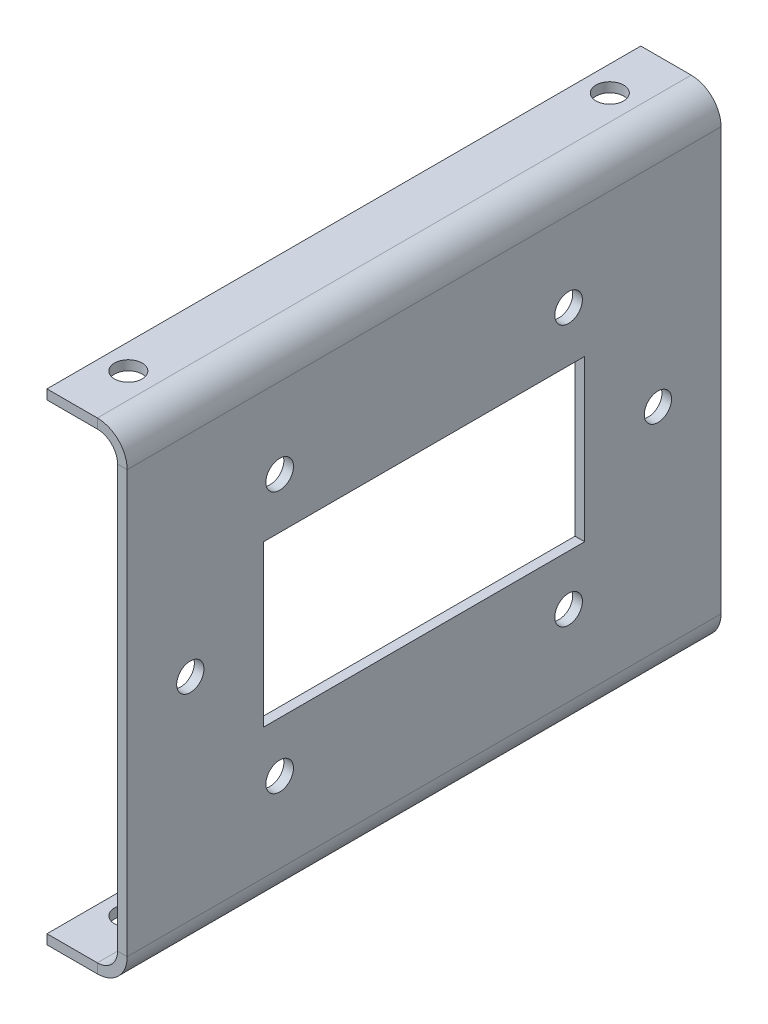
ISO-10303-21;
HEADER;
FILE_DESCRIPTION(('STEP AP214'),'2;1');
FILE_NAME('part.step','',(''),(''),'','','');
FILE_SCHEMA(('AUTOMOTIVE_DESIGN { 1 0 10303 214 1 1 1 1 }'));
ENDSEC;
DATA;
#1=APPLICATION_CONTEXT('core data for automotive mechanical design processes');
#2=APPLICATION_PROTOCOL_DEFINITION('international standard','automotive_design',2000,#1);
#3=PRODUCT_CONTEXT('',#1,'mechanical');
#4=PRODUCT('Part','Part','',(#3));
#5=PRODUCT_RELATED_PRODUCT_CATEGORY('part','',(#4));
#6=PRODUCT_DEFINITION_FORMATION('','',#4);
#7=PRODUCT_DEFINITION_CONTEXT('part definition',#1,'design');
#8=PRODUCT_DEFINITION('design','',#6,#7);
#9=PRODUCT_DEFINITION_SHAPE('','',#8);
#10=(LENGTH_UNIT() NAMED_UNIT(*) SI_UNIT(.MILLI.,.METRE.));
#11=(NAMED_UNIT(*) PLANE_ANGLE_UNIT() SI_UNIT($,.RADIAN.));
#12=(NAMED_UNIT(*) SI_UNIT($,.STERADIAN.) SOLID_ANGLE_UNIT());
#13=UNCERTAINTY_MEASURE_WITH_UNIT(LENGTH_MEASURE(1.E-05),#10,'distance_accuracy_value','');
#14=(GEOMETRIC_REPRESENTATION_CONTEXT(3) GLOBAL_UNCERTAINTY_ASSIGNED_CONTEXT((#13)) GLOBAL_UNIT_ASSIGNED_CONTEXT((#10,
#11,#12)) REPRESENTATION_CONTEXT('',''));
#15=CARTESIAN_POINT('',(0.,0.,0.));
#16=DIRECTION('',(0.,0.,1.));
#17=DIRECTION('',(1.,0.,0.));
#18=AXIS2_PLACEMENT_3D('',#15,#16,#17);
#19=CARTESIAN_POINT('',(0.,16.6878,46.99));
#20=DIRECTION('',(0.,0.,1.));
#21=DIRECTION('',(1.,0.,0.));
#22=AXIS2_PLACEMENT_3D('',#19,#20,#21);
#23=PLANE('',#22);
#24=DIRECTION('',(-1.,0.,0.));
#25=VECTOR('',#24,1.);
#26=CARTESIAN_POINT('',(0.,16.6878,46.99));
#27=LINE('',#26,#25);
#28=CARTESIAN_POINT('',(0.,16.6878,46.99));
#29=VERTEX_POINT('',#28);
#30=CARTESIAN_POINT('',(-0.761999999999995,16.6878,46.99));
#31=VERTEX_POINT('',#30);
#32=EDGE_CURVE('E11',#29,#31,#27,.T.);
#33=ORIENTED_EDGE('',*,*,#32,.F.);
#34=CARTESIAN_POINT('',(-2.3622,16.6878,46.99));
#35=DIRECTION('',(0.,0.,1.));
#36=DIRECTION('',(1.,0.,0.));
#37=AXIS2_PLACEMENT_3D('',#34,#35,#36);
#38=CIRCLE('',#37,2.3622);
#39=CARTESIAN_POINT('',(-2.3622,19.05,46.99));
#40=VERTEX_POINT('',#39);
#41=EDGE_CURVE('E247',#40,#29,#38,.F.);
#42=ORIENTED_EDGE('',*,*,#41,.F.);
#43=DIRECTION('',(0.,1.,0.));
#44=VECTOR('',#43,1.);
#45=CARTESIAN_POINT('',(-2.3622,18.288,46.99));
#46=LINE('',#45,#44);
#47=CARTESIAN_POINT('',(-2.3622,18.288,46.99));
#48=VERTEX_POINT('',#47);
#49=EDGE_CURVE('E41',#48,#40,#46,.T.);
#50=ORIENTED_EDGE('',*,*,#49,.F.);
#51=CARTESIAN_POINT('',(-2.3622,16.6878,46.99));
#52=DIRECTION('',(0.,0.,1.));
#53=DIRECTION('',(1.,0.,0.));
#54=AXIS2_PLACEMENT_3D('',#51,#52,#53);
#55=CIRCLE('',#54,1.6002);
#56=EDGE_CURVE('E259',#48,#31,#55,.F.);
#57=ORIENTED_EDGE('',*,*,#56,.T.);
#58=EDGE_LOOP('',(#33,#42,#50,#57));
#59=FACE_BOUND('',#58,.T.);
#60=ADVANCED_FACE('F33',(#59),#23,.T.);
#61=CARTESIAN_POINT('',(-2.3622,18.288,46.99));
#62=DIRECTION('',(0.,0.,1.));
#63=DIRECTION('',(1.,0.,0.));
#64=AXIS2_PLACEMENT_3D('',#61,#62,#63);
#65=PLANE('',#64);
#66=DIRECTION('',(0.,-1.,0.));
#67=VECTOR('',#66,1.);
#68=CARTESIAN_POINT('',(0.,19.05,46.99));
#69=LINE('',#68,#67);
#70=CARTESIAN_POINT('',(0.,-16.6878,46.99));
#71=VERTEX_POINT('',#70);
#72=EDGE_CURVE('E244',#29,#71,#69,.T.);
#73=ORIENTED_EDGE('',*,*,#72,.F.);
#74=ORIENTED_EDGE('',*,*,#32,.T.);
#75=DIRECTION('',(0.,1.,0.));
#76=VECTOR('',#75,1.);
#77=CARTESIAN_POINT('',(-0.761999999999995,19.05,46.99));
#78=LINE('',#77,#76);
#79=CARTESIAN_POINT('',(-0.761999999999996,-16.6878,46.99));
#80=VERTEX_POINT('',#79);
#81=EDGE_CURVE('E262',#31,#80,#78,.F.);
#82=ORIENTED_EDGE('',*,*,#81,.T.);
#83=DIRECTION('',(1.,0.,0.));
#84=VECTOR('',#83,1.);
#85=CARTESIAN_POINT('',(-0.761999999999996,-16.6878,46.99));
#86=LINE('',#85,#84);
#87=EDGE_CURVE('E338',#80,#71,#86,.T.);
#88=ORIENTED_EDGE('',*,*,#87,.T.);
#89=EDGE_LOOP('',(#73,#74,#82,#88));
#90=FACE_BOUND('',#89,.T.);
#91=ADVANCED_FACE('F373',(#90),#65,.T.);
#92=CARTESIAN_POINT('',(-2.3622,19.05,0.));
#93=DIRECTION('',(0.,0.,-1.));
#94=DIRECTION('',(-1.,0.,0.));
#95=AXIS2_PLACEMENT_3D('',#92,#93,#94);
#96=PLANE('',#95);
#97=DIRECTION('',(0.,-1.,0.));
#98=VECTOR('',#97,1.);
#99=CARTESIAN_POINT('',(-2.3622,19.05,0.));
#100=LINE('',#99,#98);
#101=CARTESIAN_POINT('',(-2.3622,19.05,0.));
#102=VERTEX_POINT('',#101);
#103=CARTESIAN_POINT('',(-2.3622,18.288,0.));
#104=VERTEX_POINT('',#103);
#105=EDGE_CURVE('E344',#102,#104,#100,.T.);
#106=ORIENTED_EDGE('',*,*,#105,.F.);
#107=CARTESIAN_POINT('',(-2.3622,16.6878,0.));
#108=DIRECTION('',(0.,0.,1.));
#109=DIRECTION('',(1.,0.,0.));
#110=AXIS2_PLACEMENT_3D('',#107,#108,#109);
#111=CIRCLE('',#110,2.3622);
#112=CARTESIAN_POINT('',(0.,16.6878,0.));
#113=VERTEX_POINT('',#112);
#114=EDGE_CURVE('E283',#102,#113,#111,.F.);
#115=ORIENTED_EDGE('',*,*,#114,.T.);
#116=DIRECTION('',(1.,0.,0.));
#117=VECTOR('',#116,1.);
#118=CARTESIAN_POINT('',(-0.761999999999995,16.6878,0.));
#119=LINE('',#118,#117);
#120=CARTESIAN_POINT('',(-0.761999999999995,16.6878,0.));
#121=VERTEX_POINT('',#120);
#122=EDGE_CURVE('E342',#121,#113,#119,.T.);
#123=ORIENTED_EDGE('',*,*,#122,.F.);
#124=CARTESIAN_POINT('',(-2.3622,16.6878,0.));
#125=DIRECTION('',(0.,0.,1.));
#126=DIRECTION('',(1.,0.,0.));
#127=AXIS2_PLACEMENT_3D('',#124,#125,#126);
#128=CIRCLE('',#127,1.6002);
#129=EDGE_CURVE('E295',#104,#121,#128,.F.);
#130=ORIENTED_EDGE('',*,*,#129,.F.);
#131=EDGE_LOOP('',(#106,#115,#123,#130));
#132=FACE_BOUND('',#131,.T.);
#133=ADVANCED_FACE('F378',(#132),#96,.T.);
#134=CARTESIAN_POINT('',(-0.761999999999995,16.6878,0.));
#135=DIRECTION('',(0.,0.,-1.));
#136=DIRECTION('',(-1.,0.,0.));
#137=AXIS2_PLACEMENT_3D('',#134,#135,#136);
#138=PLANE('',#137);
#139=DIRECTION('',(1.,0.,0.));
#140=VECTOR('',#139,1.);
#141=CARTESIAN_POINT('',(-6.35,19.05,0.));
#142=LINE('',#141,#140);
#143=CARTESIAN_POINT('',(-6.35,19.05,0.));
#144=VERTEX_POINT('',#143);
#145=EDGE_CURVE('E286',#144,#102,#142,.T.);
#146=ORIENTED_EDGE('',*,*,#145,.T.);
#147=ORIENTED_EDGE('',*,*,#105,.T.);
#148=DIRECTION('',(1.,0.,0.));
#149=VECTOR('',#148,1.);
#150=CARTESIAN_POINT('',(-6.35,18.288,0.));
#151=LINE('',#150,#149);
#152=CARTESIAN_POINT('',(-6.35,18.288,0.));
#153=VERTEX_POINT('',#152);
#154=EDGE_CURVE('E292',#153,#104,#151,.T.);
#155=ORIENTED_EDGE('',*,*,#154,.F.);
#156=DIRECTION('',(0.,1.,0.));
#157=VECTOR('',#156,1.);
#158=CARTESIAN_POINT('',(-6.35,18.288,0.));
#159=LINE('',#158,#157);
#160=EDGE_CURVE('E289',#153,#144,#159,.T.);
#161=ORIENTED_EDGE('',*,*,#160,.T.);
#162=EDGE_LOOP('',(#146,#147,#155,#161));
#163=FACE_BOUND('',#162,.T.);
#164=ADVANCED_FACE('F434',(#163),#138,.T.);
#165=CARTESIAN_POINT('',(-2.3622,-19.05,46.99));
#166=DIRECTION('',(0.,0.,1.));
#167=DIRECTION('',(1.,0.,0.));
#168=AXIS2_PLACEMENT_3D('',#165,#166,#167);
#169=PLANE('',#168);
#170=DIRECTION('',(0.,1.,0.));
#171=VECTOR('',#170,1.);
#172=CARTESIAN_POINT('',(-2.3622,-19.05,46.99));
#173=LINE('',#172,#171);
#174=CARTESIAN_POINT('',(-2.3622,-19.05,46.99));
#175=VERTEX_POINT('',#174);
#176=CARTESIAN_POINT('',(-2.36219999999999,-18.288,46.99));
#177=VERTEX_POINT('',#176);
#178=EDGE_CURVE('E340',#175,#177,#173,.T.);
#179=ORIENTED_EDGE('',*,*,#178,.F.);
#180=CARTESIAN_POINT('',(-2.3622,-16.6878,46.99));
#181=DIRECTION('',(0.,0.,1.));
#182=DIRECTION('',(1.,0.,0.));
#183=AXIS2_PLACEMENT_3D('',#180,#181,#182);
#184=CIRCLE('',#183,2.3622);
#185=EDGE_CURVE('E241',#71,#175,#184,.F.);
#186=ORIENTED_EDGE('',*,*,#185,.F.);
#187=ORIENTED_EDGE('',*,*,#87,.F.);
#188=CARTESIAN_POINT('',(-2.3622,-16.6878,46.99));
#189=DIRECTION('',(0.,0.,1.));
#190=DIRECTION('',(1.,0.,0.));
#191=AXIS2_PLACEMENT_3D('',#188,#189,#190);
#192=CIRCLE('',#191,1.6002);
#193=EDGE_CURVE('E265',#80,#177,#192,.F.);
#194=ORIENTED_EDGE('',*,*,#193,.T.);
#195=EDGE_LOOP('',(#179,#186,#187,#194));
#196=FACE_BOUND('',#195,.T.);
#197=ADVANCED_FACE('F422',(#196),#169,.T.);
#198=CARTESIAN_POINT('',(-0.761999999999996,-16.6878,46.99));
#199=DIRECTION('',(0.,0.,1.));
#200=DIRECTION('',(1.,0.,0.));
#201=AXIS2_PLACEMENT_3D('',#198,#199,#200);
#202=PLANE('',#201);
#203=DIRECTION('',(-1.,0.,0.));
#204=VECTOR('',#203,1.);
#205=CARTESIAN_POINT('',(0.,-19.05,46.99));
#206=LINE('',#205,#204);
#207=CARTESIAN_POINT('',(-6.35,-19.05,46.99));
#208=VERTEX_POINT('',#207);
#209=EDGE_CURVE('E238',#175,#208,#206,.T.);
#210=ORIENTED_EDGE('',*,*,#209,.F.);
#211=ORIENTED_EDGE('',*,*,#178,.T.);
#212=DIRECTION('',(1.,0.,0.));
#213=VECTOR('',#212,1.);
#214=CARTESIAN_POINT('',(0.,-18.288,46.99));
#215=LINE('',#214,#213);
#216=CARTESIAN_POINT('',(-6.34999999999999,-18.288,46.99));
#217=VERTEX_POINT('',#216);
#218=EDGE_CURVE('E232',#177,#217,#215,.F.);
#219=ORIENTED_EDGE('',*,*,#218,.T.);
#220=DIRECTION('',(0.,1.,0.));
#221=VECTOR('',#220,1.);
#222=CARTESIAN_POINT('',(-6.35,-19.05,46.99));
#223=LINE('',#222,#221);
#224=EDGE_CURVE('E234',#208,#217,#223,.T.);
#225=ORIENTED_EDGE('',*,*,#224,.F.);
#226=EDGE_LOOP('',(#210,#211,#219,#225));
#227=FACE_BOUND('',#226,.T.);
#228=ADVANCED_FACE('F441',(#227),#202,.T.);
#229=CARTESIAN_POINT('',(0.,-16.6878,0.));
#230=DIRECTION('',(0.,0.,-1.));
#231=DIRECTION('',(-1.,0.,0.));
#232=AXIS2_PLACEMENT_3D('',#229,#230,#231);
#233=PLANE('',#232);
#234=DIRECTION('',(-1.,0.,0.));
#235=VECTOR('',#234,1.);
#236=CARTESIAN_POINT('',(0.,-16.6878,0.));
#237=LINE('',#236,#235);
#238=CARTESIAN_POINT('',(0.,-16.6878,0.));
#239=VERTEX_POINT('',#238);
#240=CARTESIAN_POINT('',(-0.761999999999996,-16.6878,0.));
#241=VERTEX_POINT('',#240);
#242=EDGE_CURVE('E336',#239,#241,#237,.T.);
#243=ORIENTED_EDGE('',*,*,#242,.F.);
#244=CARTESIAN_POINT('',(-2.3622,-16.6878,0.));
#245=DIRECTION('',(0.,0.,1.));
#246=DIRECTION('',(1.,0.,0.));
#247=AXIS2_PLACEMENT_3D('',#244,#245,#246);
#248=CIRCLE('',#247,2.3622);
#249=CARTESIAN_POINT('',(-2.3622,-19.05,0.));
#250=VERTEX_POINT('',#249);
#251=EDGE_CURVE('E277',#239,#250,#248,.F.);
#252=ORIENTED_EDGE('',*,*,#251,.T.);
#253=DIRECTION('',(0.,-1.,0.));
#254=VECTOR('',#253,1.);
#255=CARTESIAN_POINT('',(-2.36219999999999,-18.288,0.));
#256=LINE('',#255,#254);
#257=CARTESIAN_POINT('',(-2.36219999999999,-18.288,0.));
#258=VERTEX_POINT('',#257);
#259=EDGE_CURVE('E334',#258,#250,#256,.T.);
#260=ORIENTED_EDGE('',*,*,#259,.F.);
#261=CARTESIAN_POINT('',(-2.3622,-16.6878,0.));
#262=DIRECTION('',(0.,0.,1.));
#263=DIRECTION('',(1.,0.,0.));
#264=AXIS2_PLACEMENT_3D('',#261,#262,#263);
#265=CIRCLE('',#264,1.6002);
#266=EDGE_CURVE('E235',#241,#258,#265,.F.);
#267=ORIENTED_EDGE('',*,*,#266,.F.);
#268=EDGE_LOOP('',(#243,#252,#260,#267));
#269=FACE_BOUND('',#268,.T.);
#270=ADVANCED_FACE('F447',(#269),#233,.T.);
#271=CARTESIAN_POINT('',(-2.36219999999999,-18.288,0.));
#272=DIRECTION('',(0.,0.,-1.));
#273=DIRECTION('',(-1.,0.,0.));
#274=AXIS2_PLACEMENT_3D('',#271,#272,#273);
#275=PLANE('',#274);
#276=DIRECTION('',(0.,-1.,0.));
#277=VECTOR('',#276,1.);
#278=CARTESIAN_POINT('',(0.,19.05,0.));
#279=LINE('',#278,#277);
#280=EDGE_CURVE('E280',#113,#239,#279,.T.);
#281=ORIENTED_EDGE('',*,*,#280,.T.);
#282=ORIENTED_EDGE('',*,*,#242,.T.);
#283=DIRECTION('',(0.,1.,0.));
#284=VECTOR('',#283,1.);
#285=CARTESIAN_POINT('',(-0.761999999999995,19.05,0.));
#286=LINE('',#285,#284);
#287=EDGE_CURVE('E298',#121,#241,#286,.F.);
#288=ORIENTED_EDGE('',*,*,#287,.F.);
#289=ORIENTED_EDGE('',*,*,#122,.T.);
#290=EDGE_LOOP('',(#281,#282,#288,#289));
#291=FACE_BOUND('',#290,.T.);
#292=ADVANCED_FACE('F431',(#291),#275,.T.);
#293=CARTESIAN_POINT('',(0.,-18.288,46.99));
#294=DIRECTION('',(0.,-1.,0.));
#295=DIRECTION('',(0.,0.,-1.));
#296=AXIS2_PLACEMENT_3D('',#293,#294,#295);
#297=PLANE('',#296);
#298=CARTESIAN_POINT('',(-4.3561,-18.288,42.545));
#299=DIRECTION('',(0.,-1.,0.));
#300=DIRECTION('',(0.,0.,-1.));
#301=AXIS2_PLACEMENT_3D('',#298,#299,#300);
#302=CIRCLE('',#301,1.0922);
#303=CARTESIAN_POINT('',(-4.3561,-18.288,41.4528));
#304=VERTEX_POINT('',#303);
#305=EDGE_CURVE('E202',#304,#304,#302,.T.);
#306=ORIENTED_EDGE('',*,*,#305,.T.);
#307=EDGE_LOOP('',(#306));
#308=FACE_BOUND('',#307,.T.);
#309=CARTESIAN_POINT('',(-4.3561,-18.288,4.445));
#310=DIRECTION('',(0.,-1.,0.));
#311=DIRECTION('',(0.,0.,-1.));
#312=AXIS2_PLACEMENT_3D('',#309,#310,#311);
#313=CIRCLE('',#312,1.0922);
#314=CARTESIAN_POINT('',(-4.3561,-18.288,3.35280000000001));
#315=VERTEX_POINT('',#314);
#316=EDGE_CURVE('E208',#315,#315,#313,.T.);
#317=ORIENTED_EDGE('',*,*,#316,.T.);
#318=EDGE_LOOP('',(#317));
#319=FACE_BOUND('',#318,.T.);
#320=DIRECTION('',(1.,0.,0.));
#321=VECTOR('',#320,1.);
#322=CARTESIAN_POINT('',(0.,-18.288,0.));
#323=LINE('',#322,#321);
#324=CARTESIAN_POINT('',(-6.34999999999999,-18.288,0.));
#325=VERTEX_POINT('',#324);
#326=EDGE_CURVE('E229',#258,#325,#323,.F.);
#327=ORIENTED_EDGE('',*,*,#326,.T.);
#328=DIRECTION('',(0.,0.,-1.));
#329=VECTOR('',#328,1.);
#330=CARTESIAN_POINT('',(-6.34999999999999,-18.288,46.99));
#331=LINE('',#330,#329);
#332=EDGE_CURVE('E332',#217,#325,#331,.T.);
#333=ORIENTED_EDGE('',*,*,#332,.F.);
#334=ORIENTED_EDGE('',*,*,#218,.F.);
#335=DIRECTION('',(0.,0.,-1.));
#336=VECTOR('',#335,1.);
#337=CARTESIAN_POINT('',(-2.36219999999999,-18.288,46.99));
#338=LINE('',#337,#336);
#339=EDGE_CURVE('E268',#177,#258,#338,.T.);
#340=ORIENTED_EDGE('',*,*,#339,.T.);
#341=EDGE_LOOP('',(#327,#333,#334,#340));
#342=FACE_BOUND('',#341,.T.);
#343=ADVANCED_FACE('F453',(#308,#319,#342),#297,.F.);
#344=CARTESIAN_POINT('',(-6.35,-19.05,46.99));
#345=DIRECTION('',(-1.,0.,0.));
#346=DIRECTION('',(0.,-1.,0.));
#347=AXIS2_PLACEMENT_3D('',#344,#345,#346);
#348=PLANE('',#347);
#349=DIRECTION('',(0.,1.,0.));
#350=VECTOR('',#349,1.);
#351=CARTESIAN_POINT('',(-6.35,-19.05,0.));
#352=LINE('',#351,#350);
#353=CARTESIAN_POINT('',(-6.35,-19.05,0.));
#354=VERTEX_POINT('',#353);
#355=EDGE_CURVE('E271',#354,#325,#352,.T.);
#356=ORIENTED_EDGE('',*,*,#355,.F.);
#357=DIRECTION('',(0.,0.,-1.));
#358=VECTOR('',#357,1.);
#359=CARTESIAN_POINT('',(-6.35,-19.05,46.99));
#360=LINE('',#359,#358);
#361=EDGE_CURVE('E330',#208,#354,#360,.T.);
#362=ORIENTED_EDGE('',*,*,#361,.F.);
#363=ORIENTED_EDGE('',*,*,#224,.T.);
#364=ORIENTED_EDGE('',*,*,#332,.T.);
#365=EDGE_LOOP('',(#356,#362,#363,#364));
#366=FACE_BOUND('',#365,.T.);
#367=ADVANCED_FACE('F456',(#366),#348,.T.);
#368=CARTESIAN_POINT('',(0.,-19.05,46.99));
#369=DIRECTION('',(0.,-1.,0.));
#370=DIRECTION('',(0.,0.,-1.));
#371=AXIS2_PLACEMENT_3D('',#368,#369,#370);
#372=PLANE('',#371);
#373=CARTESIAN_POINT('',(-4.3561,-19.05,42.545));
#374=DIRECTION('',(0.,-1.,0.));
#375=DIRECTION('',(0.,0.,-1.));
#376=AXIS2_PLACEMENT_3D('',#373,#374,#375);
#377=CIRCLE('',#376,1.0922);
#378=CARTESIAN_POINT('',(-4.3561,-19.05,41.4528));
#379=VERTEX_POINT('',#378);
#380=EDGE_CURVE('E199',#379,#379,#377,.T.);
#381=ORIENTED_EDGE('',*,*,#380,.F.);
#382=EDGE_LOOP('',(#381));
#383=FACE_BOUND('',#382,.T.);
#384=CARTESIAN_POINT('',(-4.3561,-19.05,4.445));
#385=DIRECTION('',(0.,-1.,0.));
#386=DIRECTION('',(0.,0.,-1.));
#387=AXIS2_PLACEMENT_3D('',#384,#385,#386);
#388=CIRCLE('',#387,1.0922);
#389=CARTESIAN_POINT('',(-4.3561,-19.05,3.35280000000001));
#390=VERTEX_POINT('',#389);
#391=EDGE_CURVE('E205',#390,#390,#388,.T.);
#392=ORIENTED_EDGE('',*,*,#391,.F.);
#393=EDGE_LOOP('',(#392));
#394=FACE_BOUND('',#393,.T.);
#395=DIRECTION('',(-1.,0.,0.));
#396=VECTOR('',#395,1.);
#397=CARTESIAN_POINT('',(0.,-19.05,0.));
#398=LINE('',#397,#396);
#399=EDGE_CURVE('E274',#250,#354,#398,.T.);
#400=ORIENTED_EDGE('',*,*,#399,.F.);
#401=DIRECTION('',(0.,0.,-1.));
#402=VECTOR('',#401,1.);
#403=CARTESIAN_POINT('',(-2.3622,-19.05,46.99));
#404=LINE('',#403,#402);
#405=EDGE_CURVE('E327',#175,#250,#404,.T.);
#406=ORIENTED_EDGE('',*,*,#405,.F.);
#407=ORIENTED_EDGE('',*,*,#209,.T.);
#408=ORIENTED_EDGE('',*,*,#361,.T.);
#409=EDGE_LOOP('',(#400,#406,#407,#408));
#410=FACE_BOUND('',#409,.T.);
#411=ADVANCED_FACE('F460',(#383,#394,#410),#372,.T.);
#412=CARTESIAN_POINT('',(-2.3622,-16.6878,46.99));
#413=DIRECTION('',(0.,0.,-1.));
#414=DIRECTION('',(-1.,0.,0.));
#415=AXIS2_PLACEMENT_3D('',#412,#413,#414);
#416=CYLINDRICAL_SURFACE('',#415,2.3622);
#417=ORIENTED_EDGE('',*,*,#251,.F.);
#418=DIRECTION('',(0.,0.,-1.));
#419=VECTOR('',#418,1.);
#420=CARTESIAN_POINT('',(0.,-16.6878,46.99));
#421=LINE('',#420,#419);
#422=EDGE_CURVE('E324',#71,#239,#421,.T.);
#423=ORIENTED_EDGE('',*,*,#422,.F.);
#424=ORIENTED_EDGE('',*,*,#185,.T.);
#425=ORIENTED_EDGE('',*,*,#405,.T.);
#426=EDGE_LOOP('',(#417,#423,#424,#425));
#427=FACE_BOUND('',#426,.T.);
#428=ADVANCED_FACE('F427',(#427),#416,.T.);
#429=CARTESIAN_POINT('',(0.,19.05,46.99));
#430=DIRECTION('',(1.,0.,0.));
#431=DIRECTION('',(0.,0.,-1.));
#432=AXIS2_PLACEMENT_3D('',#429,#430,#431);
#433=PLANE('',#432);
#434=DIRECTION('',(0.,-1.,0.));
#435=VECTOR('',#434,1.);
#436=CARTESIAN_POINT('',(0.,6.35,36.195));
#437=LINE('',#436,#435);
#438=CARTESIAN_POINT('',(0.,6.35,36.195));
#439=VERTEX_POINT('',#438);
#440=CARTESIAN_POINT('',(0.,-6.35,36.195));
#441=VERTEX_POINT('',#440);
#442=EDGE_CURVE('E49',#439,#441,#437,.T.);
#443=ORIENTED_EDGE('',*,*,#442,.F.);
#444=DIRECTION('',(0.,0.,1.));
#445=VECTOR('',#444,1.);
#446=CARTESIAN_POINT('',(0.,6.35,36.195));
#447=LINE('',#446,#445);
#448=CARTESIAN_POINT('',(0.,6.35,10.795));
#449=VERTEX_POINT('',#448);
#450=EDGE_CURVE('E164',#449,#439,#447,.T.);
#451=ORIENTED_EDGE('',*,*,#450,.F.);
#452=DIRECTION('',(0.,1.,0.));
#453=VECTOR('',#452,1.);
#454=CARTESIAN_POINT('',(0.,6.35,10.795));
#455=LINE('',#454,#453);
#456=CARTESIAN_POINT('',(0.,-6.35,10.795));
#457=VERTEX_POINT('',#456);
#458=EDGE_CURVE('E167',#457,#449,#455,.T.);
#459=ORIENTED_EDGE('',*,*,#458,.F.);
#460=DIRECTION('',(0.,0.,-1.));
#461=VECTOR('',#460,1.);
#462=CARTESIAN_POINT('',(0.,-6.35,36.195));
#463=LINE('',#462,#461);
#464=EDGE_CURVE('E173',#441,#457,#463,.T.);
#465=ORIENTED_EDGE('',*,*,#464,.F.);
#466=EDGE_LOOP('',(#443,#451,#459,#465));
#467=FACE_BOUND('',#466,.T.);
#468=CARTESIAN_POINT('',(0.,-10.3378,34.925));
#469=DIRECTION('',(1.,0.,0.));
#470=DIRECTION('',(0.,0.,-1.));
#471=AXIS2_PLACEMENT_3D('',#468,#469,#470);
#472=CIRCLE('',#471,1.0922);
#473=CARTESIAN_POINT('',(0.,-10.3378,33.8328));
#474=VERTEX_POINT('',#473);
#475=EDGE_CURVE('E191',#474,#474,#472,.T.);
#476=ORIENTED_EDGE('',*,*,#475,.F.);
#477=EDGE_LOOP('',(#476));
#478=FACE_BOUND('',#477,.T.);
#479=CARTESIAN_POINT('',(0.,-10.3378,12.065));
#480=DIRECTION('',(1.,0.,0.));
#481=DIRECTION('',(0.,0.,-1.));
#482=AXIS2_PLACEMENT_3D('',#479,#480,#481);
#483=CIRCLE('',#482,1.0922);
#484=CARTESIAN_POINT('',(0.,-10.3378,10.9728));
#485=VERTEX_POINT('',#484);
#486=EDGE_CURVE('E195',#485,#485,#483,.T.);
#487=ORIENTED_EDGE('',*,*,#486,.F.);
#488=EDGE_LOOP('',(#487));
#489=FACE_BOUND('',#488,.T.);
#490=CARTESIAN_POINT('',(0.,10.3378,34.925));
#491=DIRECTION('',(1.,0.,0.));
#492=DIRECTION('',(0.,0.,-1.));
#493=AXIS2_PLACEMENT_3D('',#490,#491,#492);
#494=CIRCLE('',#493,1.0922);
#495=CARTESIAN_POINT('',(0.,10.3378,33.8328));
#496=VERTEX_POINT('',#495);
#497=EDGE_CURVE('E211',#496,#496,#494,.T.);
#498=ORIENTED_EDGE('',*,*,#497,.F.);
#499=EDGE_LOOP('',(#498));
#500=FACE_BOUND('',#499,.T.);
#501=CARTESIAN_POINT('',(0.,10.3378,12.065));
#502=DIRECTION('',(1.,0.,0.));
#503=DIRECTION('',(0.,0.,-1.));
#504=AXIS2_PLACEMENT_3D('',#501,#502,#503);
#505=CIRCLE('',#504,1.0922);
#506=CARTESIAN_POINT('',(0.,10.3378,10.9728));
#507=VERTEX_POINT('',#506);
#508=EDGE_CURVE('E215',#507,#507,#505,.T.);
#509=ORIENTED_EDGE('',*,*,#508,.F.);
#510=EDGE_LOOP('',(#509));
#511=FACE_BOUND('',#510,.T.);
#512=CARTESIAN_POINT('',(0.,0.,4.995));
#513=DIRECTION('',(1.,0.,0.));
#514=DIRECTION('',(0.,-1.,0.));
#515=AXIS2_PLACEMENT_3D('',#512,#513,#514);
#516=CIRCLE('',#515,1.0795);
#517=CARTESIAN_POINT('',(0.,-1.0795,4.995));
#518=VERTEX_POINT('',#517);
#519=EDGE_CURVE('E223',#518,#518,#516,.T.);
#520=ORIENTED_EDGE('',*,*,#519,.F.);
#521=EDGE_LOOP('',(#520));
#522=FACE_BOUND('',#521,.T.);
#523=CARTESIAN_POINT('',(0.,0.,41.995));
#524=DIRECTION('',(1.,0.,0.));
#525=DIRECTION('',(0.,1.,0.));
#526=AXIS2_PLACEMENT_3D('',#523,#524,#525);
#527=CIRCLE('',#526,1.0795);
#528=CARTESIAN_POINT('',(0.,1.0795,41.995));
#529=VERTEX_POINT('',#528);
#530=EDGE_CURVE('E222',#529,#529,#527,.T.);
#531=ORIENTED_EDGE('',*,*,#530,.F.);
#532=EDGE_LOOP('',(#531));
#533=FACE_BOUND('',#532,.T.);
#534=ORIENTED_EDGE('',*,*,#280,.F.);
#535=DIRECTION('',(0.,0.,-1.));
#536=VECTOR('',#535,1.);
#537=CARTESIAN_POINT('',(0.,16.6878,46.99));
#538=LINE('',#537,#536);
#539=EDGE_CURVE('E321',#29,#113,#538,.T.);
#540=ORIENTED_EDGE('',*,*,#539,.F.);
#541=ORIENTED_EDGE('',*,*,#72,.T.);
#542=ORIENTED_EDGE('',*,*,#422,.T.);
#543=EDGE_LOOP('',(#534,#540,#541,#542));
#544=FACE_BOUND('',#543,.T.);
#545=ADVANCED_FACE('F387',(#467,#478,#489,#500,#511,#522,#533,#544),#433,.T.);
#546=CARTESIAN_POINT('',(-2.3622,16.6878,46.99));
#547=DIRECTION('',(0.,0.,-1.));
#548=DIRECTION('',(-1.,0.,0.));
#549=AXIS2_PLACEMENT_3D('',#546,#547,#548);
#550=CYLINDRICAL_SURFACE('',#549,2.3622);
#551=ORIENTED_EDGE('',*,*,#114,.F.);
#552=DIRECTION('',(0.,0.,-1.));
#553=VECTOR('',#552,1.);
#554=CARTESIAN_POINT('',(-2.3622,19.05,46.99));
#555=LINE('',#554,#553);
#556=EDGE_CURVE('E318',#40,#102,#555,.T.);
#557=ORIENTED_EDGE('',*,*,#556,.F.);
#558=ORIENTED_EDGE('',*,*,#41,.T.);
#559=ORIENTED_EDGE('',*,*,#539,.T.);
#560=EDGE_LOOP('',(#551,#557,#558,#559));
#561=FACE_BOUND('',#560,.T.);
#562=ADVANCED_FACE('F392',(#561),#550,.T.);
#563=CARTESIAN_POINT('',(-6.35,19.05,46.99));
#564=DIRECTION('',(0.,1.,0.));
#565=DIRECTION('',(0.,0.,1.));
#566=AXIS2_PLACEMENT_3D('',#563,#564,#565);
#567=PLANE('',#566);
#568=CARTESIAN_POINT('',(-4.3561,19.05,42.545));
#569=DIRECTION('',(0.,1.,0.));
#570=DIRECTION('',(0.,0.,1.));
#571=AXIS2_PLACEMENT_3D('',#568,#569,#570);
#572=CIRCLE('',#571,1.0922);
#573=CARTESIAN_POINT('',(-4.3561,19.05,43.6372));
#574=VERTEX_POINT('',#573);
#575=EDGE_CURVE('E179',#574,#574,#572,.T.);
#576=ORIENTED_EDGE('',*,*,#575,.F.);
#577=EDGE_LOOP('',(#576));
#578=FACE_BOUND('',#577,.T.);
#579=CARTESIAN_POINT('',(-4.3561,19.05,4.445));
#580=DIRECTION('',(0.,1.,0.));
#581=DIRECTION('',(0.,0.,1.));
#582=AXIS2_PLACEMENT_3D('',#579,#580,#581);
#583=CIRCLE('',#582,1.0922);
#584=CARTESIAN_POINT('',(-4.3561,19.05,5.5372));
#585=VERTEX_POINT('',#584);
#586=EDGE_CURVE('E185',#585,#585,#583,.T.);
#587=ORIENTED_EDGE('',*,*,#586,.F.);
#588=EDGE_LOOP('',(#587));
#589=FACE_BOUND('',#588,.T.);
#590=ORIENTED_EDGE('',*,*,#145,.F.);
#591=DIRECTION('',(0.,0.,-1.));
#592=VECTOR('',#591,1.);
#593=CARTESIAN_POINT('',(-6.35,19.05,46.99));
#594=LINE('',#593,#592);
#595=CARTESIAN_POINT('',(-6.35,19.05,46.99));
#596=VERTEX_POINT('',#595);
#597=EDGE_CURVE('E316',#596,#144,#594,.T.);
#598=ORIENTED_EDGE('',*,*,#597,.F.);
#599=DIRECTION('',(1.,0.,0.));
#600=VECTOR('',#599,1.);
#601=CARTESIAN_POINT('',(-6.35,19.05,46.99));
#602=LINE('',#601,#600);
#603=EDGE_CURVE('E250',#596,#40,#602,.T.);
#604=ORIENTED_EDGE('',*,*,#603,.T.);
#605=ORIENTED_EDGE('',*,*,#556,.T.);
#606=EDGE_LOOP('',(#590,#598,#604,#605));
#607=FACE_BOUND('',#606,.T.);
#608=ADVANCED_FACE('F395',(#578,#589,#607),#567,.T.);
#609=CARTESIAN_POINT('',(-6.35,18.288,46.99));
#610=DIRECTION('',(-1.,0.,0.));
#611=DIRECTION('',(0.,0.,1.));
#612=AXIS2_PLACEMENT_3D('',#609,#610,#611);
#613=PLANE('',#612);
#614=ORIENTED_EDGE('',*,*,#160,.F.);
#615=DIRECTION('',(0.,0.,-1.));
#616=VECTOR('',#615,1.);
#617=CARTESIAN_POINT('',(-6.35,18.288,46.99));
#618=LINE('',#617,#616);
#619=CARTESIAN_POINT('',(-6.35,18.288,46.99));
#620=VERTEX_POINT('',#619);
#621=EDGE_CURVE('E314',#620,#153,#618,.T.);
#622=ORIENTED_EDGE('',*,*,#621,.F.);
#623=DIRECTION('',(0.,1.,0.));
#624=VECTOR('',#623,1.);
#625=CARTESIAN_POINT('',(-6.35,18.288,46.99));
#626=LINE('',#625,#624);
#627=EDGE_CURVE('E253',#620,#596,#626,.T.);
#628=ORIENTED_EDGE('',*,*,#627,.T.);
#629=ORIENTED_EDGE('',*,*,#597,.T.);
#630=EDGE_LOOP('',(#614,#622,#628,#629));
#631=FACE_BOUND('',#630,.T.);
#632=ADVANCED_FACE('F402',(#631),#613,.T.);
#633=CARTESIAN_POINT('',(-6.35,18.288,46.99));
#634=DIRECTION('',(0.,1.,0.));
#635=DIRECTION('',(0.,0.,1.));
#636=AXIS2_PLACEMENT_3D('',#633,#634,#635);
#637=PLANE('',#636);
#638=CARTESIAN_POINT('',(-4.3561,18.288,42.545));
#639=DIRECTION('',(0.,1.,0.));
#640=DIRECTION('',(0.,0.,1.));
#641=AXIS2_PLACEMENT_3D('',#638,#639,#640);
#642=CIRCLE('',#641,1.0922);
#643=CARTESIAN_POINT('',(-4.3561,18.288,43.6372));
#644=VERTEX_POINT('',#643);
#645=EDGE_CURVE('E36',#644,#644,#642,.T.);
#646=ORIENTED_EDGE('',*,*,#645,.T.);
#647=EDGE_LOOP('',(#646));
#648=FACE_BOUND('',#647,.T.);
#649=CARTESIAN_POINT('',(-4.3561,18.288,4.445));
#650=DIRECTION('',(0.,1.,0.));
#651=DIRECTION('',(0.,0.,1.));
#652=AXIS2_PLACEMENT_3D('',#649,#650,#651);
#653=CIRCLE('',#652,1.0922);
#654=CARTESIAN_POINT('',(-4.3561,18.288,5.5372));
#655=VERTEX_POINT('',#654);
#656=EDGE_CURVE('E188',#655,#655,#653,.T.);
#657=ORIENTED_EDGE('',*,*,#656,.T.);
#658=EDGE_LOOP('',(#657));
#659=FACE_BOUND('',#658,.T.);
#660=ORIENTED_EDGE('',*,*,#154,.T.);
#661=DIRECTION('',(0.,0.,-1.));
#662=VECTOR('',#661,1.);
#663=CARTESIAN_POINT('',(-2.3622,18.288,46.99));
#664=LINE('',#663,#662);
#665=EDGE_CURVE('E311',#48,#104,#664,.T.);
#666=ORIENTED_EDGE('',*,*,#665,.F.);
#667=DIRECTION('',(1.,0.,0.));
#668=VECTOR('',#667,1.);
#669=CARTESIAN_POINT('',(-6.35,18.288,46.99));
#670=LINE('',#669,#668);
#671=EDGE_CURVE('E256',#620,#48,#670,.T.);
#672=ORIENTED_EDGE('',*,*,#671,.F.);
#673=ORIENTED_EDGE('',*,*,#621,.T.);
#674=EDGE_LOOP('',(#660,#666,#672,#673));
#675=FACE_BOUND('',#674,.T.);
#676=ADVANCED_FACE('F407',(#648,#659,#675),#637,.F.);
#677=CARTESIAN_POINT('',(-2.3622,16.6878,46.99));
#678=DIRECTION('',(0.,0.,-1.));
#679=DIRECTION('',(-1.,0.,0.));
#680=AXIS2_PLACEMENT_3D('',#677,#678,#679);
#681=CYLINDRICAL_SURFACE('',#680,1.6002);
#682=ORIENTED_EDGE('',*,*,#129,.T.);
#683=DIRECTION('',(0.,0.,-1.));
#684=VECTOR('',#683,1.);
#685=CARTESIAN_POINT('',(-0.761999999999995,16.6878,46.99));
#686=LINE('',#685,#684);
#687=EDGE_CURVE('E308',#31,#121,#686,.T.);
#688=ORIENTED_EDGE('',*,*,#687,.F.);
#689=ORIENTED_EDGE('',*,*,#56,.F.);
#690=ORIENTED_EDGE('',*,*,#665,.T.);
#691=EDGE_LOOP('',(#682,#688,#689,#690));
#692=FACE_BOUND('',#691,.T.);
#693=ADVANCED_FACE('F410',(#692),#681,.F.);
#694=CARTESIAN_POINT('',(-0.761999999999995,19.05,46.99));
#695=DIRECTION('',(1.,0.,0.));
#696=DIRECTION('',(0.,0.,-1.));
#697=AXIS2_PLACEMENT_3D('',#694,#695,#696);
#698=PLANE('',#697);
#699=DIRECTION('',(0.,0.,1.));
#700=VECTOR('',#699,1.);
#701=CARTESIAN_POINT('',(-0.762,6.35,36.195));
#702=LINE('',#701,#700);
#703=CARTESIAN_POINT('',(-0.762,6.35,10.795));
#704=VERTEX_POINT('',#703);
#705=CARTESIAN_POINT('',(-0.762,6.35,36.195));
#706=VERTEX_POINT('',#705);
#707=EDGE_CURVE('E154',#704,#706,#702,.T.);
#708=ORIENTED_EDGE('',*,*,#707,.T.);
#709=DIRECTION('',(0.,-1.,0.));
#710=VECTOR('',#709,1.);
#711=CARTESIAN_POINT('',(-0.762,6.35,36.195));
#712=LINE('',#711,#710);
#713=CARTESIAN_POINT('',(-0.762,-6.35,36.195));
#714=VERTEX_POINT('',#713);
#715=EDGE_CURVE('E148',#706,#714,#712,.T.);
#716=ORIENTED_EDGE('',*,*,#715,.T.);
#717=DIRECTION('',(0.,0.,-1.));
#718=VECTOR('',#717,1.);
#719=CARTESIAN_POINT('',(-0.762,-6.35,36.195));
#720=LINE('',#719,#718);
#721=CARTESIAN_POINT('',(-0.761999999999995,-6.35,10.795));
#722=VERTEX_POINT('',#721);
#723=EDGE_CURVE('E157',#714,#722,#720,.T.);
#724=ORIENTED_EDGE('',*,*,#723,.T.);
#725=DIRECTION('',(0.,1.,0.));
#726=VECTOR('',#725,1.);
#727=CARTESIAN_POINT('',(-0.762,6.35,10.795));
#728=LINE('',#727,#726);
#729=EDGE_CURVE('E57',#722,#704,#728,.T.);
#730=ORIENTED_EDGE('',*,*,#729,.T.);
#731=EDGE_LOOP('',(#708,#716,#724,#730));
#732=FACE_BOUND('',#731,.T.);
#733=CARTESIAN_POINT('',(-0.761999999999995,-10.3378,34.925));
#734=DIRECTION('',(1.,0.,0.));
#735=DIRECTION('',(0.,0.,-1.));
#736=AXIS2_PLACEMENT_3D('',#733,#734,#735);
#737=CIRCLE('',#736,1.0922);
#738=CARTESIAN_POINT('',(-0.761999999999995,-10.3378,33.8328));
#739=VERTEX_POINT('',#738);
#740=EDGE_CURVE('E194',#739,#739,#737,.T.);
#741=ORIENTED_EDGE('',*,*,#740,.T.);
#742=EDGE_LOOP('',(#741));
#743=FACE_BOUND('',#742,.T.);
#744=CARTESIAN_POINT('',(-0.761999999999995,-10.3378,12.065));
#745=DIRECTION('',(1.,0.,0.));
#746=DIRECTION('',(0.,0.,-1.));
#747=AXIS2_PLACEMENT_3D('',#744,#745,#746);
#748=CIRCLE('',#747,1.0922);
#749=CARTESIAN_POINT('',(-0.761999999999995,-10.3378,10.9728));
#750=VERTEX_POINT('',#749);
#751=EDGE_CURVE('E198',#750,#750,#748,.T.);
#752=ORIENTED_EDGE('',*,*,#751,.T.);
#753=EDGE_LOOP('',(#752));
#754=FACE_BOUND('',#753,.T.);
#755=CARTESIAN_POINT('',(-0.761999999999995,10.3378,34.925));
#756=DIRECTION('',(1.,0.,0.));
#757=DIRECTION('',(0.,0.,-1.));
#758=AXIS2_PLACEMENT_3D('',#755,#756,#757);
#759=CIRCLE('',#758,1.0922);
#760=CARTESIAN_POINT('',(-0.761999999999995,10.3378,33.8328));
#761=VERTEX_POINT('',#760);
#762=EDGE_CURVE('E214',#761,#761,#759,.T.);
#763=ORIENTED_EDGE('',*,*,#762,.T.);
#764=EDGE_LOOP('',(#763));
#765=FACE_BOUND('',#764,.T.);
#766=CARTESIAN_POINT('',(-0.761999999999995,10.3378,12.065));
#767=DIRECTION('',(1.,0.,0.));
#768=DIRECTION('',(0.,0.,-1.));
#769=AXIS2_PLACEMENT_3D('',#766,#767,#768);
#770=CIRCLE('',#769,1.0922);
#771=CARTESIAN_POINT('',(-0.761999999999995,10.3378,10.9728));
#772=VERTEX_POINT('',#771);
#773=EDGE_CURVE('E218',#772,#772,#770,.T.);
#774=ORIENTED_EDGE('',*,*,#773,.T.);
#775=EDGE_LOOP('',(#774));
#776=FACE_BOUND('',#775,.T.);
#777=CARTESIAN_POINT('',(-0.762,0.,4.995));
#778=DIRECTION('',(1.,0.,0.));
#779=DIRECTION('',(0.,-1.,0.));
#780=AXIS2_PLACEMENT_3D('',#777,#778,#779);
#781=CIRCLE('',#780,1.0795);
#782=CARTESIAN_POINT('',(-0.762,-1.0795,4.995));
#783=VERTEX_POINT('',#782);
#784=EDGE_CURVE('E219',#783,#783,#781,.T.);
#785=ORIENTED_EDGE('',*,*,#784,.T.);
#786=EDGE_LOOP('',(#785));
#787=FACE_BOUND('',#786,.T.);
#788=CARTESIAN_POINT('',(-0.762,0.,41.995));
#789=DIRECTION('',(1.,0.,0.));
#790=DIRECTION('',(0.,1.,0.));
#791=AXIS2_PLACEMENT_3D('',#788,#789,#790);
#792=CIRCLE('',#791,1.0795);
#793=CARTESIAN_POINT('',(-0.762,1.0795,41.995));
#794=VERTEX_POINT('',#793);
#795=EDGE_CURVE('E226',#794,#794,#792,.T.);
#796=ORIENTED_EDGE('',*,*,#795,.T.);
#797=EDGE_LOOP('',(#796));
#798=FACE_BOUND('',#797,.T.);
#799=ORIENTED_EDGE('',*,*,#287,.T.);
#800=DIRECTION('',(0.,0.,-1.));
#801=VECTOR('',#800,1.);
#802=CARTESIAN_POINT('',(-0.761999999999996,-16.6878,46.99));
#803=LINE('',#802,#801);
#804=EDGE_CURVE('E305',#80,#241,#803,.T.);
#805=ORIENTED_EDGE('',*,*,#804,.F.);
#806=ORIENTED_EDGE('',*,*,#81,.F.);
#807=ORIENTED_EDGE('',*,*,#687,.T.);
#808=EDGE_LOOP('',(#799,#805,#806,#807));
#809=FACE_BOUND('',#808,.T.);
#810=ADVANCED_FACE('F161',(#732,#743,#754,#765,#776,#787,#798,#809),#698,.F.);
#811=CARTESIAN_POINT('',(-2.3622,-16.6878,46.99));
#812=DIRECTION('',(0.,0.,-1.));
#813=DIRECTION('',(-1.,0.,0.));
#814=AXIS2_PLACEMENT_3D('',#811,#812,#813);
#815=CYLINDRICAL_SURFACE('',#814,1.6002);
#816=ORIENTED_EDGE('',*,*,#266,.T.);
#817=ORIENTED_EDGE('',*,*,#339,.F.);
#818=ORIENTED_EDGE('',*,*,#193,.F.);
#819=ORIENTED_EDGE('',*,*,#804,.T.);
#820=EDGE_LOOP('',(#816,#817,#818,#819));
#821=FACE_BOUND('',#820,.T.);
#822=ADVANCED_FACE('F419',(#821),#815,.F.);
#823=CARTESIAN_POINT('',(-2.3622,-16.6878,46.99));
#824=DIRECTION('',(0.,0.,1.));
#825=DIRECTION('',(1.,0.,0.));
#826=AXIS2_PLACEMENT_3D('',#823,#824,#825);
#827=PLANE('',#826);
#828=ORIENTED_EDGE('',*,*,#671,.T.);
#829=ORIENTED_EDGE('',*,*,#49,.T.);
#830=ORIENTED_EDGE('',*,*,#603,.F.);
#831=ORIENTED_EDGE('',*,*,#627,.F.);
#832=EDGE_LOOP('',(#828,#829,#830,#831));
#833=FACE_BOUND('',#832,.T.);
#834=ADVANCED_FACE('F399',(#833),#827,.T.);
#835=CARTESIAN_POINT('',(-2.3622,-16.6878,0.));
#836=DIRECTION('',(0.,0.,1.));
#837=DIRECTION('',(1.,0.,0.));
#838=AXIS2_PLACEMENT_3D('',#835,#836,#837);
#839=PLANE('',#838);
#840=ORIENTED_EDGE('',*,*,#326,.F.);
#841=ORIENTED_EDGE('',*,*,#259,.T.);
#842=ORIENTED_EDGE('',*,*,#399,.T.);
#843=ORIENTED_EDGE('',*,*,#355,.T.);
#844=EDGE_LOOP('',(#840,#841,#842,#843));
#845=FACE_BOUND('',#844,.T.);
#846=ADVANCED_FACE('F486',(#845),#839,.F.);
#847=CARTESIAN_POINT('',(-0.762,0.,41.995));
#848=DIRECTION('',(1.,0.,0.));
#849=DIRECTION('',(0.,1.,0.));
#850=AXIS2_PLACEMENT_3D('',#847,#848,#849);
#851=CYLINDRICAL_SURFACE('',#850,1.0795);
#852=ORIENTED_EDGE('',*,*,#795,.F.);
#853=EDGE_LOOP('',(#852));
#854=FACE_BOUND('',#853,.T.);
#855=ORIENTED_EDGE('',*,*,#530,.T.);
#856=EDGE_LOOP('',(#855));
#857=FACE_BOUND('',#856,.T.);
#858=ADVANCED_FACE('F489',(#854,#857),#851,.F.);
#859=CARTESIAN_POINT('',(-0.762,0.,4.995));
#860=DIRECTION('',(1.,0.,0.));
#861=DIRECTION('',(0.,1.,0.));
#862=AXIS2_PLACEMENT_3D('',#859,#860,#861);
#863=CYLINDRICAL_SURFACE('',#862,1.0795);
#864=ORIENTED_EDGE('',*,*,#784,.F.);
#865=EDGE_LOOP('',(#864));
#866=FACE_BOUND('',#865,.T.);
#867=ORIENTED_EDGE('',*,*,#519,.T.);
#868=EDGE_LOOP('',(#867));
#869=FACE_BOUND('',#868,.T.);
#870=ADVANCED_FACE('F495',(#866,#869),#863,.F.);
#871=CARTESIAN_POINT('',(0.,10.3378,12.065));
#872=DIRECTION('',(1.,0.,0.));
#873=DIRECTION('',(0.,0.,-1.));
#874=AXIS2_PLACEMENT_3D('',#871,#872,#873);
#875=CYLINDRICAL_SURFACE('',#874,1.0922);
#876=ORIENTED_EDGE('',*,*,#508,.T.);
#877=EDGE_LOOP('',(#876));
#878=FACE_BOUND('',#877,.T.);
#879=ORIENTED_EDGE('',*,*,#773,.F.);
#880=EDGE_LOOP('',(#879));
#881=FACE_BOUND('',#880,.T.);
#882=ADVANCED_FACE('F499',(#878,#881),#875,.F.);
#883=CARTESIAN_POINT('',(0.,10.3378,34.925));
#884=DIRECTION('',(1.,0.,0.));
#885=DIRECTION('',(0.,0.,-1.));
#886=AXIS2_PLACEMENT_3D('',#883,#884,#885);
#887=CYLINDRICAL_SURFACE('',#886,1.0922);
#888=ORIENTED_EDGE('',*,*,#497,.T.);
#889=EDGE_LOOP('',(#888));
#890=FACE_BOUND('',#889,.T.);
#891=ORIENTED_EDGE('',*,*,#762,.F.);
#892=EDGE_LOOP('',(#891));
#893=FACE_BOUND('',#892,.T.);
#894=ADVANCED_FACE('F503',(#890,#893),#887,.F.);
#895=CARTESIAN_POINT('',(-4.3561,-19.05,4.445));
#896=DIRECTION('',(0.,-1.,0.));
#897=DIRECTION('',(0.,0.,-1.));
#898=AXIS2_PLACEMENT_3D('',#895,#896,#897);
#899=CYLINDRICAL_SURFACE('',#898,1.0922);
#900=ORIENTED_EDGE('',*,*,#391,.T.);
#901=EDGE_LOOP('',(#900));
#902=FACE_BOUND('',#901,.T.);
#903=ORIENTED_EDGE('',*,*,#316,.F.);
#904=EDGE_LOOP('',(#903));
#905=FACE_BOUND('',#904,.T.);
#906=ADVANCED_FACE('F507',(#902,#905),#899,.F.);
#907=CARTESIAN_POINT('',(-4.3561,-19.05,42.545));
#908=DIRECTION('',(0.,-1.,0.));
#909=DIRECTION('',(0.,0.,-1.));
#910=AXIS2_PLACEMENT_3D('',#907,#908,#909);
#911=CYLINDRICAL_SURFACE('',#910,1.0922);
#912=ORIENTED_EDGE('',*,*,#380,.T.);
#913=EDGE_LOOP('',(#912));
#914=FACE_BOUND('',#913,.T.);
#915=ORIENTED_EDGE('',*,*,#305,.F.);
#916=EDGE_LOOP('',(#915));
#917=FACE_BOUND('',#916,.T.);
#918=ADVANCED_FACE('F369',(#914,#917),#911,.F.);
#919=CARTESIAN_POINT('',(0.,-10.3378,12.065));
#920=DIRECTION('',(1.,0.,0.));
#921=DIRECTION('',(0.,0.,-1.));
#922=AXIS2_PLACEMENT_3D('',#919,#920,#921);
#923=CYLINDRICAL_SURFACE('',#922,1.0922);
#924=ORIENTED_EDGE('',*,*,#486,.T.);
#925=EDGE_LOOP('',(#924));
#926=FACE_BOUND('',#925,.T.);
#927=ORIENTED_EDGE('',*,*,#751,.F.);
#928=EDGE_LOOP('',(#927));
#929=FACE_BOUND('',#928,.T.);
#930=ADVANCED_FACE('F359',(#926,#929),#923,.F.);
#931=CARTESIAN_POINT('',(0.,-10.3378,34.925));
#932=DIRECTION('',(1.,0.,0.));
#933=DIRECTION('',(0.,0.,-1.));
#934=AXIS2_PLACEMENT_3D('',#931,#932,#933);
#935=CYLINDRICAL_SURFACE('',#934,1.0922);
#936=ORIENTED_EDGE('',*,*,#475,.T.);
#937=EDGE_LOOP('',(#936));
#938=FACE_BOUND('',#937,.T.);
#939=ORIENTED_EDGE('',*,*,#740,.F.);
#940=EDGE_LOOP('',(#939));
#941=FACE_BOUND('',#940,.T.);
#942=ADVANCED_FACE('F356',(#938,#941),#935,.F.);
#943=CARTESIAN_POINT('',(-4.3561,19.05,4.445));
#944=DIRECTION('',(0.,1.,0.));
#945=DIRECTION('',(0.,0.,1.));
#946=AXIS2_PLACEMENT_3D('',#943,#944,#945);
#947=CYLINDRICAL_SURFACE('',#946,1.0922);
#948=ORIENTED_EDGE('',*,*,#586,.T.);
#949=EDGE_LOOP('',(#948));
#950=FACE_BOUND('',#949,.T.);
#951=ORIENTED_EDGE('',*,*,#656,.F.);
#952=EDGE_LOOP('',(#951));
#953=FACE_BOUND('',#952,.T.);
#954=ADVANCED_FACE('F358',(#950,#953),#947,.F.);
#955=CARTESIAN_POINT('',(-4.3561,19.05,42.545));
#956=DIRECTION('',(0.,1.,0.));
#957=DIRECTION('',(0.,0.,1.));
#958=AXIS2_PLACEMENT_3D('',#955,#956,#957);
#959=CYLINDRICAL_SURFACE('',#958,1.0922);
#960=ORIENTED_EDGE('',*,*,#575,.T.);
#961=EDGE_LOOP('',(#960));
#962=FACE_BOUND('',#961,.T.);
#963=ORIENTED_EDGE('',*,*,#645,.F.);
#964=EDGE_LOOP('',(#963));
#965=FACE_BOUND('',#964,.T.);
#966=ADVANCED_FACE('F366',(#962,#965),#959,.F.);
#967=CARTESIAN_POINT('',(-0.762,6.35,36.195));
#968=DIRECTION('',(0.,0.,1.));
#969=DIRECTION('',(0.,-1.,0.));
#970=AXIS2_PLACEMENT_3D('',#967,#968,#969);
#971=PLANE('',#970);
#972=ORIENTED_EDGE('',*,*,#442,.T.);
#973=DIRECTION('',(1.,0.,0.));
#974=VECTOR('',#973,1.);
#975=CARTESIAN_POINT('',(-0.762,-6.35,36.195));
#976=LINE('',#975,#974);
#977=EDGE_CURVE('E144',#714,#441,#976,.T.);
#978=ORIENTED_EDGE('',*,*,#977,.F.);
#979=ORIENTED_EDGE('',*,*,#715,.F.);
#980=DIRECTION('',(1.,0.,0.));
#981=VECTOR('',#980,1.);
#982=CARTESIAN_POINT('',(-0.762,6.35,36.195));
#983=LINE('',#982,#981);
#984=EDGE_CURVE('E177',#706,#439,#983,.T.);
#985=ORIENTED_EDGE('',*,*,#984,.T.);
#986=EDGE_LOOP('',(#972,#978,#979,#985));
#987=FACE_BOUND('',#986,.T.);
#988=ADVANCED_FACE('F146',(#987),#971,.F.);
#989=CARTESIAN_POINT('',(-0.762,6.35,36.195));
#990=DIRECTION('',(0.,1.,0.));
#991=DIRECTION('',(0.,0.,1.));
#992=AXIS2_PLACEMENT_3D('',#989,#990,#991);
#993=PLANE('',#992);
#994=ORIENTED_EDGE('',*,*,#450,.T.);
#995=ORIENTED_EDGE('',*,*,#984,.F.);
#996=ORIENTED_EDGE('',*,*,#707,.F.);
#997=DIRECTION('',(1.,0.,0.));
#998=VECTOR('',#997,1.);
#999=CARTESIAN_POINT('',(-0.762,6.35,10.795));
#1000=LINE('',#999,#998);
#1001=EDGE_CURVE('E180',#704,#449,#1000,.T.);
#1002=ORIENTED_EDGE('',*,*,#1001,.T.);
#1003=EDGE_LOOP('',(#994,#995,#996,#1002));
#1004=FACE_BOUND('',#1003,.T.);
#1005=ADVANCED_FACE('F587',(#1004),#993,.F.);
#1006=CARTESIAN_POINT('',(-0.762,6.35,10.795));
#1007=DIRECTION('',(0.,0.,-1.));
#1008=DIRECTION('',(0.,1.,0.));
#1009=AXIS2_PLACEMENT_3D('',#1006,#1007,#1008);
#1010=PLANE('',#1009);
#1011=ORIENTED_EDGE('',*,*,#458,.T.);
#1012=ORIENTED_EDGE('',*,*,#1001,.F.);
#1013=ORIENTED_EDGE('',*,*,#729,.F.);
#1014=DIRECTION('',(1.,0.,0.));
#1015=VECTOR('',#1014,1.);
#1016=CARTESIAN_POINT('',(-0.762,-6.35,10.795));
#1017=LINE('',#1016,#1015);
#1018=EDGE_CURVE('E153',#722,#457,#1017,.T.);
#1019=ORIENTED_EDGE('',*,*,#1018,.T.);
#1020=EDGE_LOOP('',(#1011,#1012,#1013,#1019));
#1021=FACE_BOUND('',#1020,.T.);
#1022=ADVANCED_FACE('F597',(#1021),#1010,.F.);
#1023=CARTESIAN_POINT('',(-0.762,-6.35,36.195));
#1024=DIRECTION('',(0.,-1.,0.));
#1025=DIRECTION('',(0.,0.,-1.));
#1026=AXIS2_PLACEMENT_3D('',#1023,#1024,#1025);
#1027=PLANE('',#1026);
#1028=ORIENTED_EDGE('',*,*,#464,.T.);
#1029=ORIENTED_EDGE('',*,*,#1018,.F.);
#1030=ORIENTED_EDGE('',*,*,#723,.F.);
#1031=ORIENTED_EDGE('',*,*,#977,.T.);
#1032=EDGE_LOOP('',(#1028,#1029,#1030,#1031));
#1033=FACE_BOUND('',#1032,.T.);
#1034=ADVANCED_FACE('F158',(#1033),#1027,.F.);
#1035=CLOSED_SHELL('',(#60,#91,#133,#164,#197,#228,#270,#292,#343,#367,#411,#428,#545,#562,#608,
#632,#676,#693,#810,#822,#834,#846,#858,#870,#882,#894,#906,#918,#930,#942,#954,#966,#988,#1005,
#1022,#1034));
#1036=MANIFOLD_SOLID_BREP('B2',#1035);
#1037=ADVANCED_BREP_SHAPE_REPRESENTATION('',(#18,#1036),#14);
#1038=SHAPE_DEFINITION_REPRESENTATION(#9,#1037);
ENDSEC;
END-ISO-10303-21;
